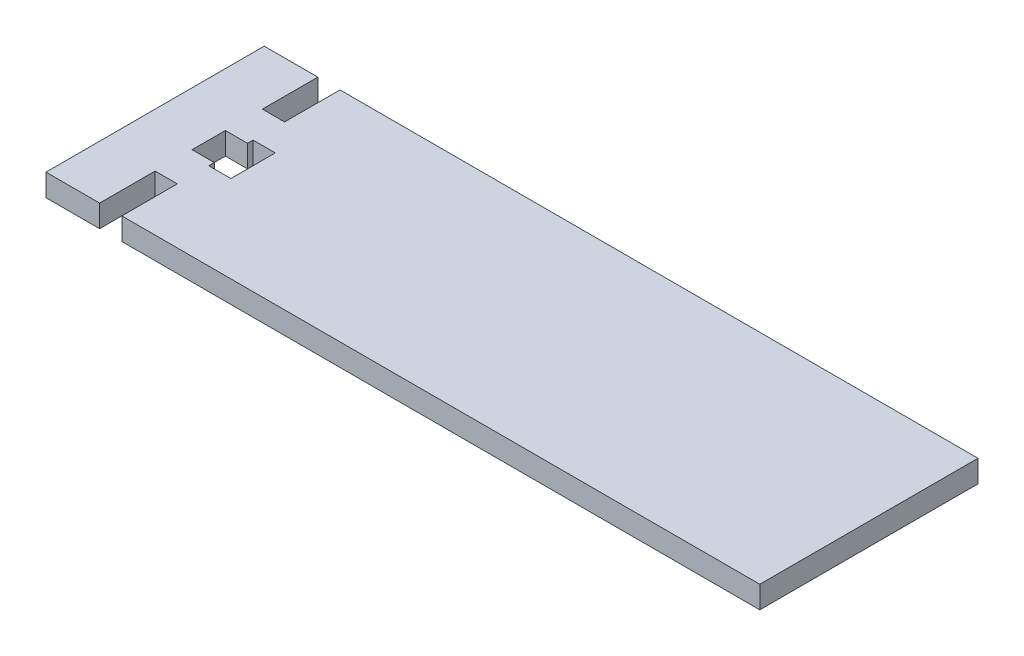
ISO-10303-21;
HEADER;
FILE_DESCRIPTION(('STEP AP214'),'2;1');
FILE_NAME('part.step','',(''),(''),'','','');
FILE_SCHEMA(('AUTOMOTIVE_DESIGN { 1 0 10303 214 1 1 1 1 }'));
ENDSEC;
DATA;
#1=APPLICATION_CONTEXT('core data for automotive mechanical design processes');
#2=APPLICATION_PROTOCOL_DEFINITION('international standard','automotive_design',2000,#1);
#3=PRODUCT_CONTEXT('',#1,'mechanical');
#4=PRODUCT('Part','Part','',(#3));
#5=PRODUCT_RELATED_PRODUCT_CATEGORY('part','',(#4));
#6=PRODUCT_DEFINITION_FORMATION('','',#4);
#7=PRODUCT_DEFINITION_CONTEXT('part definition',#1,'design');
#8=PRODUCT_DEFINITION('design','',#6,#7);
#9=PRODUCT_DEFINITION_SHAPE('','',#8);
#10=(LENGTH_UNIT() NAMED_UNIT(*) SI_UNIT(.MILLI.,.METRE.));
#11=(NAMED_UNIT(*) PLANE_ANGLE_UNIT() SI_UNIT($,.RADIAN.));
#12=(NAMED_UNIT(*) SI_UNIT($,.STERADIAN.) SOLID_ANGLE_UNIT());
#13=UNCERTAINTY_MEASURE_WITH_UNIT(LENGTH_MEASURE(1.E-05),#10,'distance_accuracy_value','');
#14=(GEOMETRIC_REPRESENTATION_CONTEXT(3) GLOBAL_UNCERTAINTY_ASSIGNED_CONTEXT((#13)) GLOBAL_UNIT_ASSIGNED_CONTEXT((#10,
#11,#12)) REPRESENTATION_CONTEXT('',''));
#15=CARTESIAN_POINT('',(0.,0.,0.));
#16=DIRECTION('',(0.,0.,1.));
#17=DIRECTION('',(1.,0.,0.));
#18=AXIS2_PLACEMENT_3D('',#15,#16,#17);
#19=CARTESIAN_POINT('',(-96.5,6.00000000000001,-29.5));
#20=DIRECTION('',(0.,0.,-1.));
#21=DIRECTION('',(-1.,0.,0.));
#22=AXIS2_PLACEMENT_3D('',#19,#20,#21);
#23=PLANE('',#22);
#24=DIRECTION('',(1.,0.,0.));
#25=VECTOR('',#24,1.);
#26=CARTESIAN_POINT('',(-96.5,0.,-29.5));
#27=LINE('',#26,#25);
#28=CARTESIAN_POINT('',(-76.,0.,-29.5));
#29=VERTEX_POINT('',#28);
#30=CARTESIAN_POINT('',(96.5,0.,-29.5));
#31=VERTEX_POINT('',#30);
#32=EDGE_CURVE('E206',#29,#31,#27,.T.);
#33=ORIENTED_EDGE('',*,*,#32,.F.);
#34=DIRECTION('',(0.,-1.,0.));
#35=VECTOR('',#34,1.);
#36=CARTESIAN_POINT('',(-76.,6.00000000000001,-29.5));
#37=LINE('',#36,#35);
#38=CARTESIAN_POINT('',(-76.,6.00000000000001,-29.5));
#39=VERTEX_POINT('',#38);
#40=EDGE_CURVE('E284',#39,#29,#37,.T.);
#41=ORIENTED_EDGE('',*,*,#40,.F.);
#42=DIRECTION('',(1.,0.,0.));
#43=VECTOR('',#42,1.);
#44=CARTESIAN_POINT('',(-96.5,6.00000000000001,-29.5));
#45=LINE('',#44,#43);
#46=CARTESIAN_POINT('',(96.5,6.00000000000001,-29.5));
#47=VERTEX_POINT('',#46);
#48=EDGE_CURVE('E295',#39,#47,#45,.T.);
#49=ORIENTED_EDGE('',*,*,#48,.T.);
#50=DIRECTION('',(0.,-1.,0.));
#51=VECTOR('',#50,1.);
#52=CARTESIAN_POINT('',(96.5,6.00000000000001,-29.5));
#53=LINE('',#52,#51);
#54=EDGE_CURVE('E41',#47,#31,#53,.T.);
#55=ORIENTED_EDGE('',*,*,#54,.T.);
#56=EDGE_LOOP('',(#33,#41,#49,#55));
#57=FACE_BOUND('',#56,.T.);
#58=ADVANCED_FACE('F37',(#57),#23,.T.);
#59=CARTESIAN_POINT('',(-96.5,6.00000000000001,29.5));
#60=DIRECTION('',(0.,0.,-1.));
#61=DIRECTION('',(-1.,0.,0.));
#62=AXIS2_PLACEMENT_3D('',#59,#60,#61);
#63=PLANE('',#62);
#64=DIRECTION('',(0.,-1.,0.));
#65=VECTOR('',#64,1.);
#66=CARTESIAN_POINT('',(-82.,6.00000000000001,29.5));
#67=LINE('',#66,#65);
#68=CARTESIAN_POINT('',(-82.,6.00000000000001,29.5));
#69=VERTEX_POINT('',#68);
#70=CARTESIAN_POINT('',(-82.,0.,29.5));
#71=VERTEX_POINT('',#70);
#72=EDGE_CURVE('E204',#69,#71,#67,.T.);
#73=ORIENTED_EDGE('',*,*,#72,.F.);
#74=DIRECTION('',(1.,0.,0.));
#75=VECTOR('',#74,1.);
#76=CARTESIAN_POINT('',(-96.5,6.00000000000001,29.5));
#77=LINE('',#76,#75);
#78=CARTESIAN_POINT('',(-96.5,6.00000000000001,29.5));
#79=VERTEX_POINT('',#78);
#80=EDGE_CURVE('E194',#79,#69,#77,.T.);
#81=ORIENTED_EDGE('',*,*,#80,.F.);
#82=DIRECTION('',(0.,-1.,0.));
#83=VECTOR('',#82,1.);
#84=CARTESIAN_POINT('',(-96.5,6.00000000000001,29.5));
#85=LINE('',#84,#83);
#86=CARTESIAN_POINT('',(-96.5,0.,29.5));
#87=VERTEX_POINT('',#86);
#88=EDGE_CURVE('E46',#79,#87,#85,.T.);
#89=ORIENTED_EDGE('',*,*,#88,.T.);
#90=DIRECTION('',(1.,0.,0.));
#91=VECTOR('',#90,1.);
#92=CARTESIAN_POINT('',(-96.5,0.,29.5));
#93=LINE('',#92,#91);
#94=EDGE_CURVE('E309',#87,#71,#93,.T.);
#95=ORIENTED_EDGE('',*,*,#94,.T.);
#96=EDGE_LOOP('',(#73,#81,#89,#95));
#97=FACE_BOUND('',#96,.T.);
#98=ADVANCED_FACE('F347',(#97),#63,.F.);
#99=CARTESIAN_POINT('',(0.,6.00000000000001,0.));
#100=DIRECTION('',(0.,-1.,0.));
#101=DIRECTION('',(0.,0.,-1.));
#102=AXIS2_PLACEMENT_3D('',#99,#100,#101);
#103=PLANE('',#102);
#104=DIRECTION('',(0.,0.,-1.));
#105=VECTOR('',#104,1.);
#106=CARTESIAN_POINT('',(-82.,6.00000000000001,0.));
#107=LINE('',#106,#105);
#108=CARTESIAN_POINT('',(-82.,6.00000000000001,4.5));
#109=VERTEX_POINT('',#108);
#110=CARTESIAN_POINT('',(-82.,6.00000000000001,-4.5));
#111=VERTEX_POINT('',#110);
#112=EDGE_CURVE('E228',#109,#111,#107,.T.);
#113=ORIENTED_EDGE('',*,*,#112,.T.);
#114=DIRECTION('',(1.,0.,-1.45861332271717E-13));
#115=VECTOR('',#114,1.);
#116=CARTESIAN_POINT('',(-6.56375995224474E-13,6.00000000000001,-4.50000000001196));
#117=LINE('',#116,#115);
#118=CARTESIAN_POINT('',(-76.,6.00000000000001,-4.50000000000088));
#119=VERTEX_POINT('',#118);
#120=EDGE_CURVE('E211',#111,#119,#117,.T.);
#121=ORIENTED_EDGE('',*,*,#120,.T.);
#122=DIRECTION('',(0.,0.,1.));
#123=VECTOR('',#122,1.);
#124=CARTESIAN_POINT('',(-76.,6.00000000000001,0.));
#125=LINE('',#124,#123);
#126=CARTESIAN_POINT('',(-76.,6.00000000000001,-6.));
#127=VERTEX_POINT('',#126);
#128=EDGE_CURVE('E214',#127,#119,#125,.T.);
#129=ORIENTED_EDGE('',*,*,#128,.F.);
#130=DIRECTION('',(-1.,0.,0.));
#131=VECTOR('',#130,1.);
#132=CARTESIAN_POINT('',(0.,6.00000000000001,-6.));
#133=LINE('',#132,#131);
#134=CARTESIAN_POINT('',(-70.,6.00000000000001,-6.));
#135=VERTEX_POINT('',#134);
#136=EDGE_CURVE('E217',#135,#127,#133,.T.);
#137=ORIENTED_EDGE('',*,*,#136,.F.);
#138=DIRECTION('',(0.,0.,1.));
#139=VECTOR('',#138,1.);
#140=CARTESIAN_POINT('',(-70.,6.00000000000001,0.));
#141=LINE('',#140,#139);
#142=CARTESIAN_POINT('',(-70.,6.00000000000001,6.00000000000001));
#143=VERTEX_POINT('',#142);
#144=EDGE_CURVE('E220',#135,#143,#141,.T.);
#145=ORIENTED_EDGE('',*,*,#144,.T.);
#146=DIRECTION('',(-1.,0.,0.));
#147=VECTOR('',#146,1.);
#148=CARTESIAN_POINT('',(0.,6.00000000000001,6.00000000000001));
#149=LINE('',#148,#147);
#150=CARTESIAN_POINT('',(-76.,6.00000000000001,6.00000000000001));
#151=VERTEX_POINT('',#150);
#152=EDGE_CURVE('E223',#143,#151,#149,.T.);
#153=ORIENTED_EDGE('',*,*,#152,.T.);
#154=CARTESIAN_POINT('',(-76.,6.00000000000001,4.49999999999912));
#155=VERTEX_POINT('',#154);
#156=EDGE_CURVE('E218',#155,#151,#125,.T.);
#157=ORIENTED_EDGE('',*,*,#156,.F.);
#158=DIRECTION('',(1.,0.,-1.46295013140712E-13));
#159=VECTOR('',#158,1.);
#160=CARTESIAN_POINT('',(6.58327559131447E-13,6.00000000000001,4.499999999988));
#161=LINE('',#160,#159);
#162=EDGE_CURVE('E226',#109,#155,#161,.T.);
#163=ORIENTED_EDGE('',*,*,#162,.F.);
#164=EDGE_LOOP('',(#113,#121,#129,#137,#145,#153,#157,#163));
#165=FACE_BOUND('',#164,.T.);
#166=DIRECTION('',(0.,0.,1.));
#167=VECTOR('',#166,1.);
#168=CARTESIAN_POINT('',(-82.,6.00000000000001,0.));
#169=LINE('',#168,#167);
#170=CARTESIAN_POINT('',(-82.,6.00000000000001,14.5));
#171=VERTEX_POINT('',#170);
#172=EDGE_CURVE('E186',#171,#69,#169,.T.);
#173=ORIENTED_EDGE('',*,*,#172,.F.);
#174=DIRECTION('',(-1.,0.,1.45716771982053E-13));
#175=VECTOR('',#174,1.);
#176=CARTESIAN_POINT('',(2.11289319373802E-12,6.00000000000001,14.499999999988));
#177=LINE('',#176,#175);
#178=CARTESIAN_POINT('',(-76.,6.00000000000001,14.4999999999991));
#179=VERTEX_POINT('',#178);
#180=EDGE_CURVE('E175',#179,#171,#177,.T.);
#181=ORIENTED_EDGE('',*,*,#180,.F.);
#182=DIRECTION('',(0.,0.,1.));
#183=VECTOR('',#182,1.);
#184=CARTESIAN_POINT('',(-76.,6.00000000000001,0.));
#185=LINE('',#184,#183);
#186=CARTESIAN_POINT('',(-76.,6.00000000000001,29.5));
#187=VERTEX_POINT('',#186);
#188=EDGE_CURVE('E185',#179,#187,#185,.T.);
#189=ORIENTED_EDGE('',*,*,#188,.T.);
#190=CARTESIAN_POINT('',(96.5,6.00000000000001,29.5));
#191=VERTEX_POINT('',#190);
#192=EDGE_CURVE('E298',#187,#191,#77,.T.);
#193=ORIENTED_EDGE('',*,*,#192,.T.);
#194=DIRECTION('',(0.,0.,1.));
#195=VECTOR('',#194,1.);
#196=CARTESIAN_POINT('',(96.5,6.00000000000001,-29.5));
#197=LINE('',#196,#195);
#198=EDGE_CURVE('E294',#47,#191,#197,.T.);
#199=ORIENTED_EDGE('',*,*,#198,.F.);
#200=ORIENTED_EDGE('',*,*,#48,.F.);
#201=DIRECTION('',(0.,0.,-1.));
#202=VECTOR('',#201,1.);
#203=CARTESIAN_POINT('',(-76.,6.00000000000001,0.));
#204=LINE('',#203,#202);
#205=CARTESIAN_POINT('',(-76.,6.00000000000001,-14.5000000000009));
#206=VERTEX_POINT('',#205);
#207=EDGE_CURVE('E274',#206,#39,#204,.T.);
#208=ORIENTED_EDGE('',*,*,#207,.F.);
#209=DIRECTION('',(-1.,0.,1.46584133720041E-13));
#210=VECTOR('',#209,1.);
#211=CARTESIAN_POINT('',(-2.12546993894236E-12,6.00000000000001,-14.500000000012));
#212=LINE('',#211,#210);
#213=CARTESIAN_POINT('',(-82.,6.00000000000001,-14.5));
#214=VERTEX_POINT('',#213);
#215=EDGE_CURVE('E267',#206,#214,#212,.T.);
#216=ORIENTED_EDGE('',*,*,#215,.T.);
#217=DIRECTION('',(0.,0.,-1.));
#218=VECTOR('',#217,1.);
#219=CARTESIAN_POINT('',(-82.,6.00000000000001,0.));
#220=LINE('',#219,#218);
#221=CARTESIAN_POINT('',(-82.,6.00000000000001,-29.5));
#222=VERTEX_POINT('',#221);
#223=EDGE_CURVE('E270',#214,#222,#220,.T.);
#224=ORIENTED_EDGE('',*,*,#223,.T.);
#225=CARTESIAN_POINT('',(-96.5,6.00000000000001,-29.5));
#226=VERTEX_POINT('',#225);
#227=EDGE_CURVE('E291',#226,#222,#45,.T.);
#228=ORIENTED_EDGE('',*,*,#227,.F.);
#229=DIRECTION('',(0.,0.,1.));
#230=VECTOR('',#229,1.);
#231=CARTESIAN_POINT('',(-96.5,6.00000000000001,-29.5));
#232=LINE('',#231,#230);
#233=EDGE_CURVE('E300',#226,#79,#232,.T.);
#234=ORIENTED_EDGE('',*,*,#233,.T.);
#235=ORIENTED_EDGE('',*,*,#80,.T.);
#236=EDGE_LOOP('',(#173,#181,#189,#193,#199,#200,#208,#216,#224,#228,#234,#235));
#237=FACE_BOUND('',#236,.T.);
#238=ADVANCED_FACE('F192',(#165,#237),#103,.F.);
#239=CARTESIAN_POINT('',(0.,0.,0.));
#240=DIRECTION('',(0.,-1.,0.));
#241=DIRECTION('',(0.,0.,-1.));
#242=AXIS2_PLACEMENT_3D('',#239,#240,#241);
#243=PLANE('',#242);
#244=DIRECTION('',(1.,0.,-1.45861332271717E-13));
#245=VECTOR('',#244,1.);
#246=CARTESIAN_POINT('',(-6.56375995224474E-13,0.,-4.50000000001196));
#247=LINE('',#246,#245);
#248=CARTESIAN_POINT('',(-82.,0.,-4.5));
#249=VERTEX_POINT('',#248);
#250=CARTESIAN_POINT('',(-76.,0.,-4.50000000000088));
#251=VERTEX_POINT('',#250);
#252=EDGE_CURVE('E232',#249,#251,#247,.T.);
#253=ORIENTED_EDGE('',*,*,#252,.F.);
#254=DIRECTION('',(0.,0.,-1.));
#255=VECTOR('',#254,1.);
#256=CARTESIAN_POINT('',(-82.,0.,0.));
#257=LINE('',#256,#255);
#258=CARTESIAN_POINT('',(-82.,0.,4.5));
#259=VERTEX_POINT('',#258);
#260=EDGE_CURVE('E215',#259,#249,#257,.T.);
#261=ORIENTED_EDGE('',*,*,#260,.F.);
#262=DIRECTION('',(1.,0.,-1.46295013140712E-13));
#263=VECTOR('',#262,1.);
#264=CARTESIAN_POINT('',(6.58327559131447E-13,0.,4.499999999988));
#265=LINE('',#264,#263);
#266=CARTESIAN_POINT('',(-76.,0.,4.49999999999912));
#267=VERTEX_POINT('',#266);
#268=EDGE_CURVE('E248',#259,#267,#265,.T.);
#269=ORIENTED_EDGE('',*,*,#268,.T.);
#270=DIRECTION('',(0.,0.,1.));
#271=VECTOR('',#270,1.);
#272=CARTESIAN_POINT('',(-76.,0.,0.));
#273=LINE('',#272,#271);
#274=CARTESIAN_POINT('',(-76.,0.,6.00000000000001));
#275=VERTEX_POINT('',#274);
#276=EDGE_CURVE('E239',#267,#275,#273,.T.);
#277=ORIENTED_EDGE('',*,*,#276,.T.);
#278=DIRECTION('',(-1.,0.,0.));
#279=VECTOR('',#278,1.);
#280=CARTESIAN_POINT('',(0.,0.,6.00000000000001));
#281=LINE('',#280,#279);
#282=CARTESIAN_POINT('',(-70.,0.,6.00000000000001));
#283=VERTEX_POINT('',#282);
#284=EDGE_CURVE('E245',#283,#275,#281,.T.);
#285=ORIENTED_EDGE('',*,*,#284,.F.);
#286=DIRECTION('',(0.,0.,1.));
#287=VECTOR('',#286,1.);
#288=CARTESIAN_POINT('',(-70.,0.,0.));
#289=LINE('',#288,#287);
#290=CARTESIAN_POINT('',(-70.,0.,-6.));
#291=VERTEX_POINT('',#290);
#292=EDGE_CURVE('E242',#291,#283,#289,.T.);
#293=ORIENTED_EDGE('',*,*,#292,.F.);
#294=DIRECTION('',(-1.,0.,0.));
#295=VECTOR('',#294,1.);
#296=CARTESIAN_POINT('',(0.,0.,-6.));
#297=LINE('',#296,#295);
#298=CARTESIAN_POINT('',(-76.,0.,-6.));
#299=VERTEX_POINT('',#298);
#300=EDGE_CURVE('E238',#291,#299,#297,.T.);
#301=ORIENTED_EDGE('',*,*,#300,.T.);
#302=EDGE_CURVE('E234',#299,#251,#273,.T.);
#303=ORIENTED_EDGE('',*,*,#302,.T.);
#304=EDGE_LOOP('',(#253,#261,#269,#277,#285,#293,#301,#303));
#305=FACE_BOUND('',#304,.T.);
#306=DIRECTION('',(-1.,0.,1.45716771982053E-13));
#307=VECTOR('',#306,1.);
#308=CARTESIAN_POINT('',(2.11289319373802E-12,0.,14.499999999988));
#309=LINE('',#308,#307);
#310=CARTESIAN_POINT('',(-76.,0.,14.4999999999991));
#311=VERTEX_POINT('',#310);
#312=CARTESIAN_POINT('',(-82.,0.,14.5));
#313=VERTEX_POINT('',#312);
#314=EDGE_CURVE('E197',#311,#313,#309,.T.);
#315=ORIENTED_EDGE('',*,*,#314,.T.);
#316=DIRECTION('',(0.,0.,1.));
#317=VECTOR('',#316,1.);
#318=CARTESIAN_POINT('',(-82.,0.,0.));
#319=LINE('',#318,#317);
#320=EDGE_CURVE('E62',#313,#71,#319,.T.);
#321=ORIENTED_EDGE('',*,*,#320,.T.);
#322=ORIENTED_EDGE('',*,*,#94,.F.);
#323=DIRECTION('',(0.,0.,1.));
#324=VECTOR('',#323,1.);
#325=CARTESIAN_POINT('',(-96.5,0.,-29.5));
#326=LINE('',#325,#324);
#327=CARTESIAN_POINT('',(-96.5,0.,-29.5));
#328=VERTEX_POINT('',#327);
#329=EDGE_CURVE('E312',#328,#87,#326,.T.);
#330=ORIENTED_EDGE('',*,*,#329,.F.);
#331=CARTESIAN_POINT('',(-82.,0.,-29.5));
#332=VERTEX_POINT('',#331);
#333=EDGE_CURVE('E302',#328,#332,#27,.T.);
#334=ORIENTED_EDGE('',*,*,#333,.T.);
#335=DIRECTION('',(0.,0.,-1.));
#336=VECTOR('',#335,1.);
#337=CARTESIAN_POINT('',(-82.,0.,0.));
#338=LINE('',#337,#336);
#339=CARTESIAN_POINT('',(-82.,0.,-14.5));
#340=VERTEX_POINT('',#339);
#341=EDGE_CURVE('E279',#340,#332,#338,.T.);
#342=ORIENTED_EDGE('',*,*,#341,.F.);
#343=DIRECTION('',(-1.,0.,1.46584133720041E-13));
#344=VECTOR('',#343,1.);
#345=CARTESIAN_POINT('',(-2.12546993894236E-12,0.,-14.500000000012));
#346=LINE('',#345,#344);
#347=CARTESIAN_POINT('',(-76.,0.,-14.5000000000009));
#348=VERTEX_POINT('',#347);
#349=EDGE_CURVE('E277',#348,#340,#346,.T.);
#350=ORIENTED_EDGE('',*,*,#349,.F.);
#351=DIRECTION('',(0.,0.,-1.));
#352=VECTOR('',#351,1.);
#353=CARTESIAN_POINT('',(-76.,0.,0.));
#354=LINE('',#353,#352);
#355=EDGE_CURVE('E271',#348,#29,#354,.T.);
#356=ORIENTED_EDGE('',*,*,#355,.T.);
#357=ORIENTED_EDGE('',*,*,#32,.T.);
#358=DIRECTION('',(0.,0.,1.));
#359=VECTOR('',#358,1.);
#360=CARTESIAN_POINT('',(96.5,0.,-29.5));
#361=LINE('',#360,#359);
#362=CARTESIAN_POINT('',(96.5,0.,29.5));
#363=VERTEX_POINT('',#362);
#364=EDGE_CURVE('E305',#31,#363,#361,.T.);
#365=ORIENTED_EDGE('',*,*,#364,.T.);
#366=CARTESIAN_POINT('',(-76.,0.,29.5));
#367=VERTEX_POINT('',#366);
#368=EDGE_CURVE('E308',#367,#363,#93,.T.);
#369=ORIENTED_EDGE('',*,*,#368,.F.);
#370=DIRECTION('',(0.,0.,1.));
#371=VECTOR('',#370,1.);
#372=CARTESIAN_POINT('',(-76.,0.,0.));
#373=LINE('',#372,#371);
#374=EDGE_CURVE('E195',#311,#367,#373,.T.);
#375=ORIENTED_EDGE('',*,*,#374,.F.);
#376=EDGE_LOOP('',(#315,#321,#322,#330,#334,#342,#350,#356,#357,#365,#369,#375));
#377=FACE_BOUND('',#376,.T.);
#378=ADVANCED_FACE('F330',(#305,#377),#243,.T.);
#379=DIRECTION('',(0.,-1.,0.));
#380=VECTOR('',#379,1.);
#381=CARTESIAN_POINT('',(-82.,6.00000000000001,-29.5));
#382=LINE('',#381,#380);
#383=EDGE_CURVE('E286',#222,#332,#382,.T.);
#384=ORIENTED_EDGE('',*,*,#383,.T.);
#385=ORIENTED_EDGE('',*,*,#333,.F.);
#386=DIRECTION('',(0.,-1.,0.));
#387=VECTOR('',#386,1.);
#388=CARTESIAN_POINT('',(-96.5,6.00000000000001,-29.5));
#389=LINE('',#388,#387);
#390=EDGE_CURVE('E11',#226,#328,#389,.T.);
#391=ORIENTED_EDGE('',*,*,#390,.F.);
#392=ORIENTED_EDGE('',*,*,#227,.T.);
#393=EDGE_LOOP('',(#384,#385,#391,#392));
#394=FACE_BOUND('',#393,.T.);
#395=ADVANCED_FACE('F39',(#394),#23,.T.);
#396=CARTESIAN_POINT('',(-96.5,6.00000000000001,-29.5));
#397=DIRECTION('',(1.,0.,0.));
#398=DIRECTION('',(0.,0.,-1.));
#399=AXIS2_PLACEMENT_3D('',#396,#397,#398);
#400=PLANE('',#399);
#401=ORIENTED_EDGE('',*,*,#329,.T.);
#402=ORIENTED_EDGE('',*,*,#88,.F.);
#403=ORIENTED_EDGE('',*,*,#233,.F.);
#404=ORIENTED_EDGE('',*,*,#390,.T.);
#405=EDGE_LOOP('',(#401,#402,#403,#404));
#406=FACE_BOUND('',#405,.T.);
#407=ADVANCED_FACE('F351',(#406),#400,.F.);
#408=ORIENTED_EDGE('',*,*,#192,.F.);
#409=DIRECTION('',(0.,-1.,0.));
#410=VECTOR('',#409,1.);
#411=CARTESIAN_POINT('',(-76.,6.00000000000001,29.5));
#412=LINE('',#411,#410);
#413=EDGE_CURVE('E207',#187,#367,#412,.T.);
#414=ORIENTED_EDGE('',*,*,#413,.T.);
#415=ORIENTED_EDGE('',*,*,#368,.T.);
#416=DIRECTION('',(0.,-1.,0.));
#417=VECTOR('',#416,1.);
#418=CARTESIAN_POINT('',(96.5,6.00000000000001,29.5));
#419=LINE('',#418,#417);
#420=EDGE_CURVE('E315',#191,#363,#419,.T.);
#421=ORIENTED_EDGE('',*,*,#420,.F.);
#422=EDGE_LOOP('',(#408,#414,#415,#421));
#423=FACE_BOUND('',#422,.T.);
#424=ADVANCED_FACE('F341',(#423),#63,.F.);
#425=CARTESIAN_POINT('',(96.5,6.00000000000001,-29.5));
#426=DIRECTION('',(1.,0.,0.));
#427=DIRECTION('',(0.,0.,-1.));
#428=AXIS2_PLACEMENT_3D('',#425,#426,#427);
#429=PLANE('',#428);
#430=ORIENTED_EDGE('',*,*,#364,.F.);
#431=ORIENTED_EDGE('',*,*,#54,.F.);
#432=ORIENTED_EDGE('',*,*,#198,.T.);
#433=ORIENTED_EDGE('',*,*,#420,.T.);
#434=EDGE_LOOP('',(#430,#431,#432,#433));
#435=FACE_BOUND('',#434,.T.);
#436=ADVANCED_FACE('F327',(#435),#429,.T.);
#437=CARTESIAN_POINT('',(-2.12546993894236E-12,6.00000000000001,-14.500000000012));
#438=DIRECTION('',(1.46584133720041E-13,0.,1.));
#439=DIRECTION('',(1.,0.,-1.46584133720041E-13));
#440=AXIS2_PLACEMENT_3D('',#437,#438,#439);
#441=PLANE('',#440);
#442=ORIENTED_EDGE('',*,*,#349,.T.);
#443=DIRECTION('',(0.,-1.,0.));
#444=VECTOR('',#443,1.);
#445=CARTESIAN_POINT('',(-82.,6.00000000000001,-14.5));
#446=LINE('',#445,#444);
#447=EDGE_CURVE('E276',#214,#340,#446,.T.);
#448=ORIENTED_EDGE('',*,*,#447,.F.);
#449=ORIENTED_EDGE('',*,*,#215,.F.);
#450=DIRECTION('',(0.,-1.,0.));
#451=VECTOR('',#450,1.);
#452=CARTESIAN_POINT('',(-76.,6.00000000000001,-14.5000000000009));
#453=LINE('',#452,#451);
#454=EDGE_CURVE('E235',#206,#348,#453,.T.);
#455=ORIENTED_EDGE('',*,*,#454,.T.);
#456=EDGE_LOOP('',(#442,#448,#449,#455));
#457=FACE_BOUND('',#456,.T.);
#458=ADVANCED_FACE('F359',(#457),#441,.F.);
#459=CARTESIAN_POINT('',(-76.,6.00000000000001,0.));
#460=DIRECTION('',(-1.,0.,0.));
#461=DIRECTION('',(0.,0.,1.));
#462=AXIS2_PLACEMENT_3D('',#459,#460,#461);
#463=PLANE('',#462);
#464=ORIENTED_EDGE('',*,*,#355,.F.);
#465=ORIENTED_EDGE('',*,*,#454,.F.);
#466=ORIENTED_EDGE('',*,*,#207,.T.);
#467=ORIENTED_EDGE('',*,*,#40,.T.);
#468=EDGE_LOOP('',(#464,#465,#466,#467));
#469=FACE_BOUND('',#468,.T.);
#470=ADVANCED_FACE('F336',(#469),#463,.T.);
#471=CARTESIAN_POINT('',(-82.,6.00000000000001,0.));
#472=DIRECTION('',(-1.,0.,0.));
#473=DIRECTION('',(0.,0.,1.));
#474=AXIS2_PLACEMENT_3D('',#471,#472,#473);
#475=PLANE('',#474);
#476=ORIENTED_EDGE('',*,*,#341,.T.);
#477=ORIENTED_EDGE('',*,*,#383,.F.);
#478=ORIENTED_EDGE('',*,*,#223,.F.);
#479=ORIENTED_EDGE('',*,*,#447,.T.);
#480=EDGE_LOOP('',(#476,#477,#478,#479));
#481=FACE_BOUND('',#480,.T.);
#482=ADVANCED_FACE('F357',(#481),#475,.F.);
#483=CARTESIAN_POINT('',(-6.56375995224474E-13,6.00000000000001,-4.50000000001196));
#484=DIRECTION('',(-1.45861332271717E-13,0.,-1.));
#485=DIRECTION('',(-1.,0.,1.45861332271717E-13));
#486=AXIS2_PLACEMENT_3D('',#483,#484,#485);
#487=PLANE('',#486);
#488=ORIENTED_EDGE('',*,*,#252,.T.);
#489=DIRECTION('',(0.,-1.,0.));
#490=VECTOR('',#489,1.);
#491=CARTESIAN_POINT('',(-76.,6.00000000000001,-4.50000000000088));
#492=LINE('',#491,#490);
#493=EDGE_CURVE('E231',#119,#251,#492,.T.);
#494=ORIENTED_EDGE('',*,*,#493,.F.);
#495=ORIENTED_EDGE('',*,*,#120,.F.);
#496=DIRECTION('',(0.,-1.,0.));
#497=VECTOR('',#496,1.);
#498=CARTESIAN_POINT('',(-82.,6.00000000000001,-4.5));
#499=LINE('',#498,#497);
#500=EDGE_CURVE('E202',#111,#249,#499,.T.);
#501=ORIENTED_EDGE('',*,*,#500,.T.);
#502=EDGE_LOOP('',(#488,#494,#495,#501));
#503=FACE_BOUND('',#502,.T.);
#504=ADVANCED_FACE('F462',(#503),#487,.F.);
#505=CARTESIAN_POINT('',(-82.,6.00000000000001,0.));
#506=DIRECTION('',(-1.,0.,0.));
#507=DIRECTION('',(0.,0.,1.));
#508=AXIS2_PLACEMENT_3D('',#505,#506,#507);
#509=PLANE('',#508);
#510=ORIENTED_EDGE('',*,*,#260,.T.);
#511=ORIENTED_EDGE('',*,*,#500,.F.);
#512=ORIENTED_EDGE('',*,*,#112,.F.);
#513=DIRECTION('',(0.,-1.,0.));
#514=VECTOR('',#513,1.);
#515=CARTESIAN_POINT('',(-82.,6.00000000000001,4.5));
#516=LINE('',#515,#514);
#517=EDGE_CURVE('E254',#109,#259,#516,.T.);
#518=ORIENTED_EDGE('',*,*,#517,.T.);
#519=EDGE_LOOP('',(#510,#511,#512,#518));
#520=FACE_BOUND('',#519,.T.);
#521=ADVANCED_FACE('F470',(#520),#509,.F.);
#522=CARTESIAN_POINT('',(6.58327559131447E-13,6.00000000000001,4.499999999988));
#523=DIRECTION('',(-1.46295013140712E-13,0.,-1.));
#524=DIRECTION('',(-1.,0.,1.46295013140712E-13));
#525=AXIS2_PLACEMENT_3D('',#522,#523,#524);
#526=PLANE('',#525);
#527=ORIENTED_EDGE('',*,*,#268,.F.);
#528=ORIENTED_EDGE('',*,*,#517,.F.);
#529=ORIENTED_EDGE('',*,*,#162,.T.);
#530=DIRECTION('',(0.,-1.,0.));
#531=VECTOR('',#530,1.);
#532=CARTESIAN_POINT('',(-76.,6.00000000000001,4.49999999999912));
#533=LINE('',#532,#531);
#534=EDGE_CURVE('E256',#155,#267,#533,.T.);
#535=ORIENTED_EDGE('',*,*,#534,.T.);
#536=EDGE_LOOP('',(#527,#528,#529,#535));
#537=FACE_BOUND('',#536,.T.);
#538=ADVANCED_FACE('F480',(#537),#526,.T.);
#539=CARTESIAN_POINT('',(-76.,6.00000000000001,0.));
#540=DIRECTION('',(1.,0.,0.));
#541=DIRECTION('',(0.,0.,-1.));
#542=AXIS2_PLACEMENT_3D('',#539,#540,#541);
#543=PLANE('',#542);
#544=ORIENTED_EDGE('',*,*,#276,.F.);
#545=ORIENTED_EDGE('',*,*,#534,.F.);
#546=ORIENTED_EDGE('',*,*,#156,.T.);
#547=DIRECTION('',(0.,-1.,0.));
#548=VECTOR('',#547,1.);
#549=CARTESIAN_POINT('',(-76.,6.00000000000001,6.00000000000001));
#550=LINE('',#549,#548);
#551=EDGE_CURVE('E258',#151,#275,#550,.T.);
#552=ORIENTED_EDGE('',*,*,#551,.T.);
#553=EDGE_LOOP('',(#544,#545,#546,#552));
#554=FACE_BOUND('',#553,.T.);
#555=ADVANCED_FACE('F490',(#554),#543,.T.);
#556=CARTESIAN_POINT('',(0.,6.00000000000001,6.00000000000001));
#557=DIRECTION('',(0.,0.,1.));
#558=DIRECTION('',(1.,0.,0.));
#559=AXIS2_PLACEMENT_3D('',#556,#557,#558);
#560=PLANE('',#559);
#561=ORIENTED_EDGE('',*,*,#284,.T.);
#562=ORIENTED_EDGE('',*,*,#551,.F.);
#563=ORIENTED_EDGE('',*,*,#152,.F.);
#564=DIRECTION('',(0.,-1.,0.));
#565=VECTOR('',#564,1.);
#566=CARTESIAN_POINT('',(-70.,6.00000000000001,6.00000000000001));
#567=LINE('',#566,#565);
#568=EDGE_CURVE('E260',#143,#283,#567,.T.);
#569=ORIENTED_EDGE('',*,*,#568,.T.);
#570=EDGE_LOOP('',(#561,#562,#563,#569));
#571=FACE_BOUND('',#570,.T.);
#572=ADVANCED_FACE('F500',(#571),#560,.F.);
#573=CARTESIAN_POINT('',(-70.,6.00000000000001,0.));
#574=DIRECTION('',(1.,0.,0.));
#575=DIRECTION('',(0.,0.,-1.));
#576=AXIS2_PLACEMENT_3D('',#573,#574,#575);
#577=PLANE('',#576);
#578=ORIENTED_EDGE('',*,*,#292,.T.);
#579=ORIENTED_EDGE('',*,*,#568,.F.);
#580=ORIENTED_EDGE('',*,*,#144,.F.);
#581=DIRECTION('',(0.,-1.,0.));
#582=VECTOR('',#581,1.);
#583=CARTESIAN_POINT('',(-70.,6.00000000000001,-6.));
#584=LINE('',#583,#582);
#585=EDGE_CURVE('E262',#135,#291,#584,.T.);
#586=ORIENTED_EDGE('',*,*,#585,.T.);
#587=EDGE_LOOP('',(#578,#579,#580,#586));
#588=FACE_BOUND('',#587,.T.);
#589=ADVANCED_FACE('F511',(#588),#577,.F.);
#590=CARTESIAN_POINT('',(0.,6.00000000000001,-6.));
#591=DIRECTION('',(0.,0.,1.));
#592=DIRECTION('',(1.,0.,0.));
#593=AXIS2_PLACEMENT_3D('',#590,#591,#592);
#594=PLANE('',#593);
#595=ORIENTED_EDGE('',*,*,#300,.F.);
#596=ORIENTED_EDGE('',*,*,#585,.F.);
#597=ORIENTED_EDGE('',*,*,#136,.T.);
#598=DIRECTION('',(0.,-1.,0.));
#599=VECTOR('',#598,1.);
#600=CARTESIAN_POINT('',(-76.,6.00000000000001,-6.));
#601=LINE('',#600,#599);
#602=EDGE_CURVE('E54',#127,#299,#601,.T.);
#603=ORIENTED_EDGE('',*,*,#602,.T.);
#604=EDGE_LOOP('',(#595,#596,#597,#603));
#605=FACE_BOUND('',#604,.T.);
#606=ADVANCED_FACE('F521',(#605),#594,.T.);
#607=ORIENTED_EDGE('',*,*,#302,.F.);
#608=ORIENTED_EDGE('',*,*,#602,.F.);
#609=ORIENTED_EDGE('',*,*,#128,.T.);
#610=ORIENTED_EDGE('',*,*,#493,.T.);
#611=EDGE_LOOP('',(#607,#608,#609,#610));
#612=FACE_BOUND('',#611,.T.);
#613=ADVANCED_FACE('F503',(#612),#543,.T.);
#614=CARTESIAN_POINT('',(-82.,6.00000000000001,0.));
#615=DIRECTION('',(1.,0.,0.));
#616=DIRECTION('',(0.,0.,-1.));
#617=AXIS2_PLACEMENT_3D('',#614,#615,#616);
#618=PLANE('',#617);
#619=ORIENTED_EDGE('',*,*,#320,.F.);
#620=DIRECTION('',(0.,-1.,0.));
#621=VECTOR('',#620,1.);
#622=CARTESIAN_POINT('',(-82.,6.00000000000001,14.5));
#623=LINE('',#622,#621);
#624=EDGE_CURVE('E178',#171,#313,#623,.T.);
#625=ORIENTED_EDGE('',*,*,#624,.F.);
#626=ORIENTED_EDGE('',*,*,#172,.T.);
#627=ORIENTED_EDGE('',*,*,#72,.T.);
#628=EDGE_LOOP('',(#619,#625,#626,#627));
#629=FACE_BOUND('',#628,.T.);
#630=ADVANCED_FACE('F188',(#629),#618,.T.);
#631=CARTESIAN_POINT('',(-76.,6.00000000000001,0.));
#632=DIRECTION('',(1.,0.,0.));
#633=DIRECTION('',(0.,0.,-1.));
#634=AXIS2_PLACEMENT_3D('',#631,#632,#633);
#635=PLANE('',#634);
#636=ORIENTED_EDGE('',*,*,#374,.T.);
#637=ORIENTED_EDGE('',*,*,#413,.F.);
#638=ORIENTED_EDGE('',*,*,#188,.F.);
#639=DIRECTION('',(0.,-1.,0.));
#640=VECTOR('',#639,1.);
#641=CARTESIAN_POINT('',(-76.,6.00000000000001,14.4999999999991));
#642=LINE('',#641,#640);
#643=EDGE_CURVE('E180',#179,#311,#642,.T.);
#644=ORIENTED_EDGE('',*,*,#643,.T.);
#645=EDGE_LOOP('',(#636,#637,#638,#644));
#646=FACE_BOUND('',#645,.T.);
#647=ADVANCED_FACE('F343',(#646),#635,.F.);
#648=CARTESIAN_POINT('',(2.11289319373802E-12,6.00000000000001,14.499999999988));
#649=DIRECTION('',(1.45716771982053E-13,0.,1.));
#650=DIRECTION('',(1.,0.,-1.45716771982053E-13));
#651=AXIS2_PLACEMENT_3D('',#648,#649,#650);
#652=PLANE('',#651);
#653=ORIENTED_EDGE('',*,*,#314,.F.);
#654=ORIENTED_EDGE('',*,*,#643,.F.);
#655=ORIENTED_EDGE('',*,*,#180,.T.);
#656=ORIENTED_EDGE('',*,*,#624,.T.);
#657=EDGE_LOOP('',(#653,#654,#655,#656));
#658=FACE_BOUND('',#657,.T.);
#659=ADVANCED_FACE('F177',(#658),#652,.T.);
#660=CLOSED_SHELL('',(#58,#98,#238,#378,#395,#407,#424,#436,#458,#470,#482,#504,#521,#538,#555,
#572,#589,#606,#613,#630,#647,#659));
#661=MANIFOLD_SOLID_BREP('B2',#660);
#662=ADVANCED_BREP_SHAPE_REPRESENTATION('',(#18,#661),#14);
#663=SHAPE_DEFINITION_REPRESENTATION(#9,#662);
ENDSEC;
END-ISO-10303-21;
